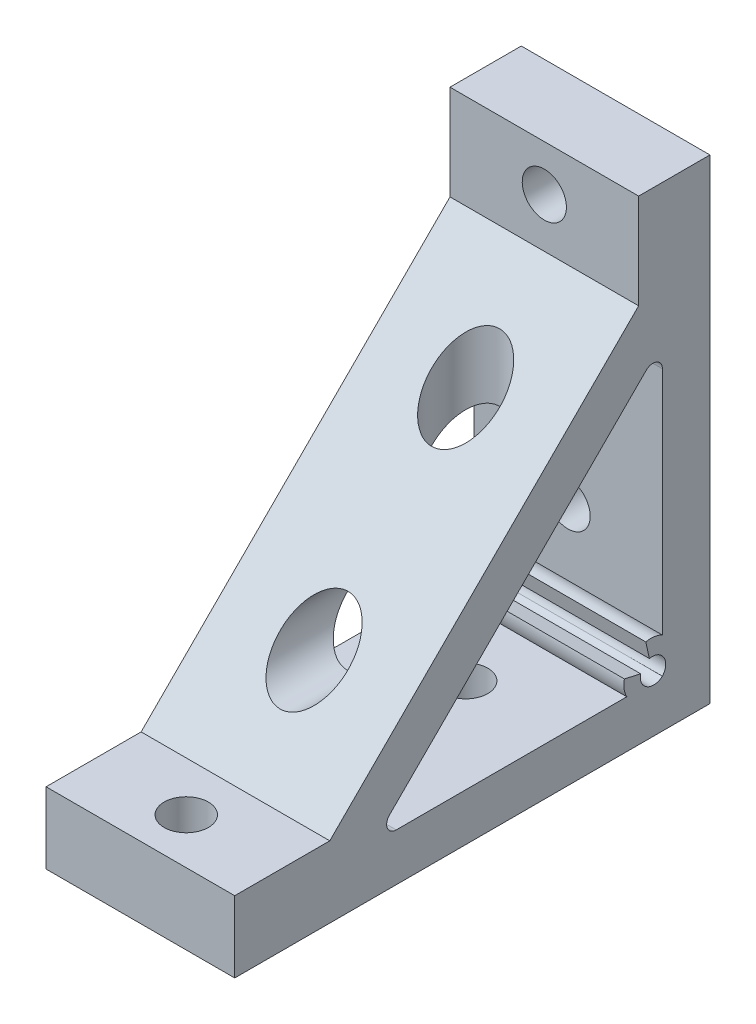
ISO-10303-21;
HEADER;
FILE_DESCRIPTION(('STEP AP214'),'2;1');
FILE_NAME('part.step','',(''),(''),'','','');
FILE_SCHEMA(('AUTOMOTIVE_DESIGN { 1 0 10303 214 1 1 1 1 }'));
ENDSEC;
DATA;
#1=APPLICATION_CONTEXT('core data for automotive mechanical design processes');
#2=APPLICATION_PROTOCOL_DEFINITION('international standard','automotive_design',2000,#1);
#3=PRODUCT_CONTEXT('',#1,'mechanical');
#4=PRODUCT('Part','Part','',(#3));
#5=PRODUCT_RELATED_PRODUCT_CATEGORY('part','',(#4));
#6=PRODUCT_DEFINITION_FORMATION('','',#4);
#7=PRODUCT_DEFINITION_CONTEXT('part definition',#1,'design');
#8=PRODUCT_DEFINITION('design','',#6,#7);
#9=PRODUCT_DEFINITION_SHAPE('','',#8);
#10=(LENGTH_UNIT() NAMED_UNIT(*) SI_UNIT(.MILLI.,.METRE.));
#11=(NAMED_UNIT(*) PLANE_ANGLE_UNIT() SI_UNIT($,.RADIAN.));
#12=(NAMED_UNIT(*) SI_UNIT($,.STERADIAN.) SOLID_ANGLE_UNIT());
#13=UNCERTAINTY_MEASURE_WITH_UNIT(LENGTH_MEASURE(1.E-05),#10,'distance_accuracy_value','');
#14=(GEOMETRIC_REPRESENTATION_CONTEXT(3) GLOBAL_UNCERTAINTY_ASSIGNED_CONTEXT((#13)) GLOBAL_UNIT_ASSIGNED_CONTEXT((#10,
#11,#12)) REPRESENTATION_CONTEXT('',''));
#15=CARTESIAN_POINT('',(0.,0.,0.));
#16=DIRECTION('',(0.,0.,1.));
#17=DIRECTION('',(1.,0.,0.));
#18=AXIS2_PLACEMENT_3D('',#15,#16,#17);
#19=CARTESIAN_POINT('',(0.,100.,40.35));
#20=DIRECTION('',(0.,-1.,0.));
#21=DIRECTION('',(0.,0.,1.));
#22=AXIS2_PLACEMENT_3D('',#19,#20,#21);
#23=CYLINDRICAL_SURFACE('',#22,4.65);
#24=CARTESIAN_POINT('',(0.,15.,40.35));
#25=DIRECTION('',(0.,1.,0.));
#26=DIRECTION('',(0.,0.,1.));
#27=AXIS2_PLACEMENT_3D('',#24,#25,#26);
#28=CIRCLE('',#27,4.65);
#29=CARTESIAN_POINT('',(0.,15.,45.));
#30=VERTEX_POINT('',#29);
#31=EDGE_CURVE('E23',#30,#30,#28,.T.);
#32=ORIENTED_EDGE('',*,*,#31,.T.);
#33=EDGE_LOOP('',(#32));
#34=FACE_BOUND('',#33,.T.);
#35=CARTESIAN_POINT('',(0.,0.,40.35));
#36=DIRECTION('',(0.,-1.,0.));
#37=DIRECTION('',(0.,0.,-1.));
#38=AXIS2_PLACEMENT_3D('',#35,#36,#37);
#39=CIRCLE('',#38,4.65);
#40=CARTESIAN_POINT('',(0.,0.,35.7));
#41=VERTEX_POINT('',#40);
#42=EDGE_CURVE('E10',#41,#41,#39,.T.);
#43=ORIENTED_EDGE('',*,*,#42,.T.);
#44=EDGE_LOOP('',(#43));
#45=FACE_BOUND('',#44,.T.);
#46=ADVANCED_FACE('F16',(#34,#45),#23,.F.);
#47=CARTESIAN_POINT('',(0.,100.,-18.45));
#48=DIRECTION('',(0.,-1.,0.));
#49=DIRECTION('',(0.,0.,1.));
#50=AXIS2_PLACEMENT_3D('',#47,#48,#49);
#51=CYLINDRICAL_SURFACE('',#50,4.65);
#52=CARTESIAN_POINT('',(0.,9.99999999999999,-18.45));
#53=DIRECTION('',(0.,1.,0.));
#54=DIRECTION('',(0.,0.,1.));
#55=AXIS2_PLACEMENT_3D('',#52,#53,#54);
#56=CIRCLE('',#55,4.65);
#57=CARTESIAN_POINT('',(0.,9.99999999999999,-13.8));
#58=VERTEX_POINT('',#57);
#59=EDGE_CURVE('E306',#58,#58,#56,.T.);
#60=ORIENTED_EDGE('',*,*,#59,.T.);
#61=EDGE_LOOP('',(#60));
#62=FACE_BOUND('',#61,.T.);
#63=CARTESIAN_POINT('',(0.,0.,-18.45));
#64=DIRECTION('',(0.,-1.,0.));
#65=DIRECTION('',(0.,0.,-1.));
#66=AXIS2_PLACEMENT_3D('',#63,#64,#65);
#67=CIRCLE('',#66,4.65);
#68=CARTESIAN_POINT('',(0.,0.,-23.1));
#69=VERTEX_POINT('',#68);
#70=EDGE_CURVE('E309',#69,#69,#67,.T.);
#71=ORIENTED_EDGE('',*,*,#70,.T.);
#72=EDGE_LOOP('',(#71));
#73=FACE_BOUND('',#72,.T.);
#74=ADVANCED_FACE('F367',(#62,#73),#51,.F.);
#75=CARTESIAN_POINT('',(0.,100.,-18.45));
#76=DIRECTION('',(0.,-1.,0.));
#77=DIRECTION('',(0.,0.,1.));
#78=AXIS2_PLACEMENT_3D('',#75,#76,#77);
#79=CYLINDRICAL_SURFACE('',#78,7.15);
#80=CARTESIAN_POINT('',(0.,49.3078643762691,-18.45));
#81=DIRECTION('',(0.,-0.707106781186547,-0.707106781186547));
#82=DIRECTION('',(0.,-0.707106781186548,0.707106781186548));
#83=AXIS2_PLACEMENT_3D('',#80,#81,#82);
#84=ELLIPSE('',#83,10.1116269709676,7.15);
#85=CARTESIAN_POINT('',(0.,42.1578643762691,-11.3));
#86=VERTEX_POINT('',#85);
#87=EDGE_CURVE('E288',#86,#86,#84,.T.);
#88=ORIENTED_EDGE('',*,*,#87,.T.);
#89=EDGE_LOOP('',(#88));
#90=FACE_BOUND('',#89,.T.);
#91=CARTESIAN_POINT('',(0.,63.45,-18.45));
#92=DIRECTION('',(0.,0.707106781186547,0.707106781186548));
#93=DIRECTION('',(0.,-0.707106781186548,0.707106781186547));
#94=AXIS2_PLACEMENT_3D('',#91,#92,#93);
#95=ELLIPSE('',#94,10.1116269709676,7.15);
#96=CARTESIAN_POINT('',(0.,56.3,-11.3));
#97=VERTEX_POINT('',#96);
#98=EDGE_CURVE('E303',#97,#97,#95,.T.);
#99=ORIENTED_EDGE('',*,*,#98,.T.);
#100=EDGE_LOOP('',(#99));
#101=FACE_BOUND('',#100,.T.);
#102=ADVANCED_FACE('F371',(#90,#101),#79,.F.);
#103=CARTESIAN_POINT('',(19.85,15.,50.));
#104=DIRECTION('',(0.,0.,-1.));
#105=DIRECTION('',(-1.,0.,0.));
#106=AXIS2_PLACEMENT_3D('',#103,#104,#105);
#107=PLANE('',#106);
#108=DIRECTION('',(0.,-1.,0.));
#109=VECTOR('',#108,1.);
#110=CARTESIAN_POINT('',(-19.85,15.,50.));
#111=LINE('',#110,#109);
#112=CARTESIAN_POINT('',(-19.85,15.,50.));
#113=VERTEX_POINT('',#112);
#114=CARTESIAN_POINT('',(-19.85,0.,50.));
#115=VERTEX_POINT('',#114);
#116=EDGE_CURVE('E195',#113,#115,#111,.T.);
#117=ORIENTED_EDGE('',*,*,#116,.T.);
#118=DIRECTION('',(-1.,0.,0.));
#119=VECTOR('',#118,1.);
#120=CARTESIAN_POINT('',(19.85,0.,50.));
#121=LINE('',#120,#119);
#122=CARTESIAN_POINT('',(19.85,0.,50.));
#123=VERTEX_POINT('',#122);
#124=EDGE_CURVE('E247',#123,#115,#121,.T.);
#125=ORIENTED_EDGE('',*,*,#124,.F.);
#126=DIRECTION('',(0.,-1.,0.));
#127=VECTOR('',#126,1.);
#128=CARTESIAN_POINT('',(19.85,15.,50.));
#129=LINE('',#128,#127);
#130=CARTESIAN_POINT('',(19.85,15.,50.));
#131=VERTEX_POINT('',#130);
#132=EDGE_CURVE('E200',#131,#123,#129,.T.);
#133=ORIENTED_EDGE('',*,*,#132,.F.);
#134=DIRECTION('',(-1.,0.,0.));
#135=VECTOR('',#134,1.);
#136=CARTESIAN_POINT('',(19.85,15.,50.));
#137=LINE('',#136,#135);
#138=EDGE_CURVE('E216',#131,#113,#137,.T.);
#139=ORIENTED_EDGE('',*,*,#138,.T.);
#140=EDGE_LOOP('',(#117,#125,#133,#139));
#141=FACE_BOUND('',#140,.T.);
#142=ADVANCED_FACE('F330',(#141),#107,.F.);
#143=CARTESIAN_POINT('',(19.85,0.,50.));
#144=DIRECTION('',(0.,1.,0.));
#145=DIRECTION('',(0.,0.,1.));
#146=AXIS2_PLACEMENT_3D('',#143,#144,#145);
#147=PLANE('',#146);
#148=ORIENTED_EDGE('',*,*,#70,.F.);
#149=EDGE_LOOP('',(#148));
#150=FACE_BOUND('',#149,.T.);
#151=ORIENTED_EDGE('',*,*,#42,.F.);
#152=EDGE_LOOP('',(#151));
#153=FACE_BOUND('',#152,.T.);
#154=DIRECTION('',(0.,0.,-1.));
#155=VECTOR('',#154,1.);
#156=CARTESIAN_POINT('',(-19.85,0.,50.));
#157=LINE('',#156,#155);
#158=CARTESIAN_POINT('',(-19.85,0.,-50.));
#159=VERTEX_POINT('',#158);
#160=EDGE_CURVE('E219',#115,#159,#157,.T.);
#161=ORIENTED_EDGE('',*,*,#160,.T.);
#162=DIRECTION('',(-1.,0.,0.));
#163=VECTOR('',#162,1.);
#164=CARTESIAN_POINT('',(19.85,0.,-50.));
#165=LINE('',#164,#163);
#166=CARTESIAN_POINT('',(19.85,0.,-50.));
#167=VERTEX_POINT('',#166);
#168=EDGE_CURVE('E244',#167,#159,#165,.T.);
#169=ORIENTED_EDGE('',*,*,#168,.F.);
#170=DIRECTION('',(0.,0.,-1.));
#171=VECTOR('',#170,1.);
#172=CARTESIAN_POINT('',(19.85,0.,50.));
#173=LINE('',#172,#171);
#174=EDGE_CURVE('E203',#123,#167,#173,.T.);
#175=ORIENTED_EDGE('',*,*,#174,.F.);
#176=ORIENTED_EDGE('',*,*,#124,.T.);
#177=EDGE_LOOP('',(#161,#169,#175,#176));
#178=FACE_BOUND('',#177,.T.);
#179=ADVANCED_FACE('F337',(#150,#153,#178),#147,.F.);
#180=CARTESIAN_POINT('',(19.85,0.,-50.));
#181=DIRECTION('',(0.,0.,1.));
#182=DIRECTION('',(0.,-1.,0.));
#183=AXIS2_PLACEMENT_3D('',#180,#181,#182);
#184=PLANE('',#183);
#185=CARTESIAN_POINT('',(0.,90.35,-50.));
#186=DIRECTION('',(0.,0.,1.));
#187=DIRECTION('',(0.,-1.,0.));
#188=AXIS2_PLACEMENT_3D('',#185,#186,#187);
#189=CIRCLE('',#188,4.65);
#190=CARTESIAN_POINT('',(0.,85.7,-50.));
#191=VERTEX_POINT('',#190);
#192=EDGE_CURVE('E297',#191,#191,#189,.T.);
#193=ORIENTED_EDGE('',*,*,#192,.T.);
#194=EDGE_LOOP('',(#193));
#195=FACE_BOUND('',#194,.T.);
#196=CARTESIAN_POINT('',(0.,31.55,-50.));
#197=DIRECTION('',(0.,0.,1.));
#198=DIRECTION('',(0.,-1.,0.));
#199=AXIS2_PLACEMENT_3D('',#196,#197,#198);
#200=CIRCLE('',#199,4.65);
#201=CARTESIAN_POINT('',(0.,26.9,-50.));
#202=VERTEX_POINT('',#201);
#203=EDGE_CURVE('E292',#202,#202,#200,.T.);
#204=ORIENTED_EDGE('',*,*,#203,.T.);
#205=EDGE_LOOP('',(#204));
#206=FACE_BOUND('',#205,.T.);
#207=DIRECTION('',(0.,1.,0.));
#208=VECTOR('',#207,1.);
#209=CARTESIAN_POINT('',(-19.85,0.,-50.));
#210=LINE('',#209,#208);
#211=CARTESIAN_POINT('',(-19.85,100.,-50.));
#212=VERTEX_POINT('',#211);
#213=EDGE_CURVE('E221',#159,#212,#210,.T.);
#214=ORIENTED_EDGE('',*,*,#213,.T.);
#215=DIRECTION('',(-1.,0.,0.));
#216=VECTOR('',#215,1.);
#217=CARTESIAN_POINT('',(19.85,100.,-50.));
#218=LINE('',#217,#216);
#219=CARTESIAN_POINT('',(19.85,100.,-50.));
#220=VERTEX_POINT('',#219);
#221=EDGE_CURVE('E241',#220,#212,#218,.T.);
#222=ORIENTED_EDGE('',*,*,#221,.F.);
#223=DIRECTION('',(0.,1.,0.));
#224=VECTOR('',#223,1.);
#225=CARTESIAN_POINT('',(19.85,0.,-50.));
#226=LINE('',#225,#224);
#227=EDGE_CURVE('E206',#167,#220,#226,.T.);
#228=ORIENTED_EDGE('',*,*,#227,.F.);
#229=ORIENTED_EDGE('',*,*,#168,.T.);
#230=EDGE_LOOP('',(#214,#222,#228,#229));
#231=FACE_BOUND('',#230,.T.);
#232=ADVANCED_FACE('F352',(#195,#206,#231),#184,.F.);
#233=CARTESIAN_POINT('',(19.85,100.,-50.));
#234=DIRECTION('',(0.,-1.,0.));
#235=DIRECTION('',(0.,0.,-1.));
#236=AXIS2_PLACEMENT_3D('',#233,#234,#235);
#237=PLANE('',#236);
#238=DIRECTION('',(0.,0.,1.));
#239=VECTOR('',#238,1.);
#240=CARTESIAN_POINT('',(-19.85,100.,-50.));
#241=LINE('',#240,#239);
#242=CARTESIAN_POINT('',(-19.85,100.,-35.));
#243=VERTEX_POINT('',#242);
#244=EDGE_CURVE('E223',#212,#243,#241,.T.);
#245=ORIENTED_EDGE('',*,*,#244,.T.);
#246=DIRECTION('',(-1.,0.,0.));
#247=VECTOR('',#246,1.);
#248=CARTESIAN_POINT('',(19.85,100.,-35.));
#249=LINE('',#248,#247);
#250=CARTESIAN_POINT('',(19.85,100.,-35.));
#251=VERTEX_POINT('',#250);
#252=EDGE_CURVE('E238',#251,#243,#249,.T.);
#253=ORIENTED_EDGE('',*,*,#252,.F.);
#254=DIRECTION('',(0.,0.,1.));
#255=VECTOR('',#254,1.);
#256=CARTESIAN_POINT('',(19.85,100.,-50.));
#257=LINE('',#256,#255);
#258=EDGE_CURVE('E208',#220,#251,#257,.T.);
#259=ORIENTED_EDGE('',*,*,#258,.F.);
#260=ORIENTED_EDGE('',*,*,#221,.T.);
#261=EDGE_LOOP('',(#245,#253,#259,#260));
#262=FACE_BOUND('',#261,.T.);
#263=ADVANCED_FACE('F349',(#262),#237,.F.);
#264=CARTESIAN_POINT('',(19.85,100.,-35.));
#265=DIRECTION('',(0.,0.,-1.));
#266=DIRECTION('',(0.,1.,0.));
#267=AXIS2_PLACEMENT_3D('',#264,#265,#266);
#268=PLANE('',#267);
#269=CARTESIAN_POINT('',(0.,90.35,-35.));
#270=DIRECTION('',(0.,0.,-1.));
#271=DIRECTION('',(0.,1.,0.));
#272=AXIS2_PLACEMENT_3D('',#269,#270,#271);
#273=CIRCLE('',#272,4.65);
#274=CARTESIAN_POINT('',(0.,95.,-35.));
#275=VERTEX_POINT('',#274);
#276=EDGE_CURVE('E294',#275,#275,#273,.T.);
#277=ORIENTED_EDGE('',*,*,#276,.T.);
#278=EDGE_LOOP('',(#277));
#279=FACE_BOUND('',#278,.T.);
#280=DIRECTION('',(0.,-1.,0.));
#281=VECTOR('',#280,1.);
#282=CARTESIAN_POINT('',(-19.85,100.,-35.));
#283=LINE('',#282,#281);
#284=CARTESIAN_POINT('',(-19.85,80.,-35.));
#285=VERTEX_POINT('',#284);
#286=EDGE_CURVE('E225',#243,#285,#283,.T.);
#287=ORIENTED_EDGE('',*,*,#286,.T.);
#288=DIRECTION('',(-1.,0.,0.));
#289=VECTOR('',#288,1.);
#290=CARTESIAN_POINT('',(19.85,80.,-35.));
#291=LINE('',#290,#289);
#292=CARTESIAN_POINT('',(19.85,80.,-35.));
#293=VERTEX_POINT('',#292);
#294=EDGE_CURVE('E235',#293,#285,#291,.T.);
#295=ORIENTED_EDGE('',*,*,#294,.F.);
#296=DIRECTION('',(0.,-1.,0.));
#297=VECTOR('',#296,1.);
#298=CARTESIAN_POINT('',(19.85,100.,-35.));
#299=LINE('',#298,#297);
#300=EDGE_CURVE('E210',#251,#293,#299,.T.);
#301=ORIENTED_EDGE('',*,*,#300,.F.);
#302=ORIENTED_EDGE('',*,*,#252,.T.);
#303=EDGE_LOOP('',(#287,#295,#301,#302));
#304=FACE_BOUND('',#303,.T.);
#305=ADVANCED_FACE('F345',(#279,#304),#268,.F.);
#306=CARTESIAN_POINT('',(19.85,80.,-35.));
#307=DIRECTION('',(0.,-0.707106781186547,-0.707106781186548));
#308=DIRECTION('',(0.,0.707106781186548,-0.707106781186547));
#309=AXIS2_PLACEMENT_3D('',#306,#307,#308);
#310=PLANE('',#309);
#311=ORIENTED_EDGE('',*,*,#98,.F.);
#312=EDGE_LOOP('',(#311));
#313=FACE_BOUND('',#312,.T.);
#314=CARTESIAN_POINT('',(0.,31.55,13.45));
#315=DIRECTION('',(0.,-0.707106781186547,-0.707106781186548));
#316=DIRECTION('',(0.,0.707106781186548,-0.707106781186547));
#317=AXIS2_PLACEMENT_3D('',#314,#315,#316);
#318=ELLIPSE('',#317,10.1116269709676,7.15);
#319=CARTESIAN_POINT('',(0.,38.7,6.30000000000003));
#320=VERTEX_POINT('',#319);
#321=EDGE_CURVE('E293',#320,#320,#318,.T.);
#322=ORIENTED_EDGE('',*,*,#321,.T.);
#323=EDGE_LOOP('',(#322));
#324=FACE_BOUND('',#323,.T.);
#325=DIRECTION('',(0.,-0.707106781186547,0.707106781186547));
#326=VECTOR('',#325,1.);
#327=CARTESIAN_POINT('',(-19.85,80.,-35.));
#328=LINE('',#327,#326);
#329=CARTESIAN_POINT('',(-19.85,15.,30.));
#330=VERTEX_POINT('',#329);
#331=EDGE_CURVE('E227',#285,#330,#328,.T.);
#332=ORIENTED_EDGE('',*,*,#331,.T.);
#333=DIRECTION('',(-1.,0.,0.));
#334=VECTOR('',#333,1.);
#335=CARTESIAN_POINT('',(19.85,15.,30.));
#336=LINE('',#335,#334);
#337=CARTESIAN_POINT('',(19.85,15.,30.));
#338=VERTEX_POINT('',#337);
#339=EDGE_CURVE('E232',#338,#330,#336,.T.);
#340=ORIENTED_EDGE('',*,*,#339,.F.);
#341=DIRECTION('',(0.,-0.707106781186547,0.707106781186547));
#342=VECTOR('',#341,1.);
#343=CARTESIAN_POINT('',(19.85,80.,-35.));
#344=LINE('',#343,#342);
#345=EDGE_CURVE('E212',#293,#338,#344,.T.);
#346=ORIENTED_EDGE('',*,*,#345,.F.);
#347=ORIENTED_EDGE('',*,*,#294,.T.);
#348=EDGE_LOOP('',(#332,#340,#346,#347));
#349=FACE_BOUND('',#348,.T.);
#350=ADVANCED_FACE('F319',(#313,#324,#349),#310,.F.);
#351=CARTESIAN_POINT('',(19.85,15.,30.));
#352=DIRECTION('',(0.,-1.,0.));
#353=DIRECTION('',(0.,0.,-1.));
#354=AXIS2_PLACEMENT_3D('',#351,#352,#353);
#355=PLANE('',#354);
#356=ORIENTED_EDGE('',*,*,#31,.F.);
#357=EDGE_LOOP('',(#356));
#358=FACE_BOUND('',#357,.T.);
#359=DIRECTION('',(0.,0.,1.));
#360=VECTOR('',#359,1.);
#361=CARTESIAN_POINT('',(-19.85,15.,30.));
#362=LINE('',#361,#360);
#363=EDGE_CURVE('E204',#330,#113,#362,.T.);
#364=ORIENTED_EDGE('',*,*,#363,.T.);
#365=ORIENTED_EDGE('',*,*,#138,.F.);
#366=DIRECTION('',(0.,0.,1.));
#367=VECTOR('',#366,1.);
#368=CARTESIAN_POINT('',(19.85,15.,30.));
#369=LINE('',#368,#367);
#370=EDGE_CURVE('E214',#338,#131,#369,.T.);
#371=ORIENTED_EDGE('',*,*,#370,.F.);
#372=ORIENTED_EDGE('',*,*,#339,.T.);
#373=EDGE_LOOP('',(#364,#365,#371,#372));
#374=FACE_BOUND('',#373,.T.);
#375=ADVANCED_FACE('F316',(#358,#374),#355,.F.);
#376=CARTESIAN_POINT('',(19.85,0.,0.));
#377=DIRECTION('',(1.,0.,0.));
#378=DIRECTION('',(0.,0.,-1.));
#379=AXIS2_PLACEMENT_3D('',#376,#377,#378);
#380=PLANE('',#379);
#381=DIRECTION('',(0.,0.,1.));
#382=VECTOR('',#381,1.);
#383=CARTESIAN_POINT('',(19.85,9.99999999999969,20.8578643762694));
#384=LINE('',#383,#382);
#385=CARTESIAN_POINT('',(19.85,9.99999999999992,-32.5));
#386=VERTEX_POINT('',#385);
#387=CARTESIAN_POINT('',(19.85,9.99999999999971,16.0294372515232));
#388=VERTEX_POINT('',#387);
#389=EDGE_CURVE('E183',#386,#388,#384,.T.);
#390=ORIENTED_EDGE('',*,*,#389,.T.);
#391=CARTESIAN_POINT('',(19.85,11.9999999999997,16.0294372515232));
#392=DIRECTION('',(1.,0.,0.));
#393=DIRECTION('',(0.,0.,-1.));
#394=AXIS2_PLACEMENT_3D('',#391,#392,#393);
#395=CIRCLE('',#394,2.);
#396=CARTESIAN_POINT('',(19.85,13.4142135623728,17.4436508138963));
#397=VERTEX_POINT('',#396);
#398=EDGE_CURVE('E284',#388,#397,#395,.F.);
#399=ORIENTED_EDGE('',*,*,#398,.T.);
#400=DIRECTION('',(0.,0.707106781186548,-0.707106781186547));
#401=VECTOR('',#400,1.);
#402=CARTESIAN_POINT('',(19.85,70.8578643762691,-40.));
#403=LINE('',#402,#401);
#404=CARTESIAN_POINT('',(19.85,67.443650813896,-36.5857864376269));
#405=VERTEX_POINT('',#404);
#406=EDGE_CURVE('E169',#397,#405,#403,.T.);
#407=ORIENTED_EDGE('',*,*,#406,.T.);
#408=CARTESIAN_POINT('',(19.85,66.0294372515229,-38.));
#409=DIRECTION('',(1.,0.,0.));
#410=DIRECTION('',(0.,0.,-1.));
#411=AXIS2_PLACEMENT_3D('',#408,#409,#410);
#412=CIRCLE('',#411,2.);
#413=CARTESIAN_POINT('',(19.85,66.0294372515229,-40.));
#414=VERTEX_POINT('',#413);
#415=EDGE_CURVE('E38',#405,#414,#412,.F.);
#416=ORIENTED_EDGE('',*,*,#415,.T.);
#417=DIRECTION('',(0.,-1.,0.));
#418=VECTOR('',#417,1.);
#419=CARTESIAN_POINT('',(19.85,17.5,-40.));
#420=LINE('',#419,#418);
#421=CARTESIAN_POINT('',(19.85,17.5,-40.));
#422=VERTEX_POINT('',#421);
#423=EDGE_CURVE('E167',#414,#422,#420,.T.);
#424=ORIENTED_EDGE('',*,*,#423,.T.);
#425=CARTESIAN_POINT('',(19.85,13.119935205637,-37.5885621722338));
#426=DIRECTION('',(1.,0.,0.));
#427=DIRECTION('',(0.,0.,-1.));
#428=AXIS2_PLACEMENT_3D('',#425,#426,#427);
#429=CIRCLE('',#428,5.00000000000001);
#430=CARTESIAN_POINT('',(19.85,18.,-36.5));
#431=VERTEX_POINT('',#430);
#432=EDGE_CURVE('E147',#422,#431,#429,.T.);
#433=ORIENTED_EDGE('',*,*,#432,.T.);
#434=DIRECTION('',(0.,-0.976012958872607,-0.217712434446771));
#435=VECTOR('',#434,1.);
#436=CARTESIAN_POINT('',(19.85,18.,-36.5));
#437=LINE('',#436,#435);
#438=CARTESIAN_POINT('',(19.85,14.5839546439459,-37.2619935205637));
#439=VERTEX_POINT('',#438);
#440=EDGE_CURVE('E158',#431,#439,#437,.T.);
#441=ORIENTED_EDGE('',*,*,#440,.T.);
#442=CARTESIAN_POINT('',(19.85,11.8398785064693,-37.8740955329052));
#443=DIRECTION('',(-1.,0.,0.));
#444=DIRECTION('',(0.,0.,1.));
#445=AXIS2_PLACEMENT_3D('',#442,#443,#444);
#446=CIRCLE('',#445,2.81151608954691);
#447=CARTESIAN_POINT('',(19.85,10.,-40.));
#448=VERTEX_POINT('',#447);
#449=EDGE_CURVE('E162',#439,#448,#446,.T.);
#450=ORIENTED_EDGE('',*,*,#449,.T.);
#451=CARTESIAN_POINT('',(19.85,12.1259044670948,-38.1601214935307));
#452=DIRECTION('',(-1.,0.,0.));
#453=DIRECTION('',(0.,0.,-1.));
#454=AXIS2_PLACEMENT_3D('',#451,#452,#453);
#455=CIRCLE('',#454,2.81151608954691);
#456=CARTESIAN_POINT('',(19.85,12.7380064794363,-35.4160453560541));
#457=VERTEX_POINT('',#456);
#458=EDGE_CURVE('E174',#448,#457,#455,.T.);
#459=ORIENTED_EDGE('',*,*,#458,.T.);
#460=DIRECTION('',(0.,0.21771243444676,0.976012958872609));
#461=VECTOR('',#460,1.);
#462=CARTESIAN_POINT('',(19.85,13.5,-32.));
#463=LINE('',#462,#461);
#464=CARTESIAN_POINT('',(19.85,13.5,-32.));
#465=VERTEX_POINT('',#464);
#466=EDGE_CURVE('E177',#457,#465,#463,.T.);
#467=ORIENTED_EDGE('',*,*,#466,.T.);
#468=CARTESIAN_POINT('',(19.85,12.4114378277662,-36.880064794363));
#469=DIRECTION('',(1.,0.,0.));
#470=DIRECTION('',(0.,0.,1.));
#471=AXIS2_PLACEMENT_3D('',#468,#469,#470);
#472=CIRCLE('',#471,5.00000000000001);
#473=EDGE_CURVE('E180',#465,#386,#472,.T.);
#474=ORIENTED_EDGE('',*,*,#473,.T.);
#475=EDGE_LOOP('',(#390,#399,#407,#416,#424,#433,#441,#450,#459,#467,#474));
#476=FACE_BOUND('',#475,.T.);
#477=ORIENTED_EDGE('',*,*,#132,.T.);
#478=ORIENTED_EDGE('',*,*,#174,.T.);
#479=ORIENTED_EDGE('',*,*,#227,.T.);
#480=ORIENTED_EDGE('',*,*,#258,.T.);
#481=ORIENTED_EDGE('',*,*,#300,.T.);
#482=ORIENTED_EDGE('',*,*,#345,.T.);
#483=ORIENTED_EDGE('',*,*,#370,.T.);
#484=EDGE_LOOP('',(#477,#478,#479,#480,#481,#482,#483));
#485=FACE_BOUND('',#484,.T.);
#486=ADVANCED_FACE('F165',(#476,#485),#380,.T.);
#487=CARTESIAN_POINT('',(-19.85,0.,0.));
#488=DIRECTION('',(1.,0.,0.));
#489=DIRECTION('',(0.,0.,-1.));
#490=AXIS2_PLACEMENT_3D('',#487,#488,#489);
#491=PLANE('',#490);
#492=DIRECTION('',(0.,1.,0.));
#493=VECTOR('',#492,1.);
#494=CARTESIAN_POINT('',(-19.85,0.,-40.));
#495=LINE('',#494,#493);
#496=CARTESIAN_POINT('',(-19.85,17.5,-40.));
#497=VERTEX_POINT('',#496);
#498=CARTESIAN_POINT('',(-19.85,66.0294372515229,-40.));
#499=VERTEX_POINT('',#498);
#500=EDGE_CURVE('E250',#497,#499,#495,.T.);
#501=ORIENTED_EDGE('',*,*,#500,.T.);
#502=CARTESIAN_POINT('',(-19.85,66.0294372515229,-38.));
#503=DIRECTION('',(1.,0.,0.));
#504=DIRECTION('',(0.,0.,-1.));
#505=AXIS2_PLACEMENT_3D('',#502,#503,#504);
#506=CIRCLE('',#505,2.);
#507=CARTESIAN_POINT('',(-19.85,67.443650813896,-36.5857864376269));
#508=VERTEX_POINT('',#507);
#509=EDGE_CURVE('E30',#499,#508,#506,.T.);
#510=ORIENTED_EDGE('',*,*,#509,.T.);
#511=DIRECTION('',(0.,-0.707106781186548,0.707106781186547));
#512=VECTOR('',#511,1.);
#513=CARTESIAN_POINT('',(-19.85,15.4289321881345,15.4289321881345));
#514=LINE('',#513,#512);
#515=CARTESIAN_POINT('',(-19.85,13.4142135623728,17.4436508138963));
#516=VERTEX_POINT('',#515);
#517=EDGE_CURVE('E263',#508,#516,#514,.T.);
#518=ORIENTED_EDGE('',*,*,#517,.T.);
#519=CARTESIAN_POINT('',(-19.85,11.9999999999997,16.0294372515232));
#520=DIRECTION('',(1.,0.,0.));
#521=DIRECTION('',(0.,0.,-1.));
#522=AXIS2_PLACEMENT_3D('',#519,#520,#521);
#523=CIRCLE('',#522,2.);
#524=CARTESIAN_POINT('',(-19.85,9.99999999999971,16.0294372515232));
#525=VERTEX_POINT('',#524);
#526=EDGE_CURVE('E282',#516,#525,#523,.T.);
#527=ORIENTED_EDGE('',*,*,#526,.T.);
#528=DIRECTION('',(0.,0.,-1.));
#529=VECTOR('',#528,1.);
#530=CARTESIAN_POINT('',(-19.85,9.99999999999978,0.));
#531=LINE('',#530,#529);
#532=CARTESIAN_POINT('',(-19.85,9.99999999999991,-32.5));
#533=VERTEX_POINT('',#532);
#534=EDGE_CURVE('E261',#525,#533,#531,.T.);
#535=ORIENTED_EDGE('',*,*,#534,.T.);
#536=CARTESIAN_POINT('',(-19.85,12.4114378277662,-36.880064794363));
#537=DIRECTION('',(-1.,0.,0.));
#538=DIRECTION('',(0.,0.,1.));
#539=AXIS2_PLACEMENT_3D('',#536,#537,#538);
#540=CIRCLE('',#539,5.00000000000001);
#541=CARTESIAN_POINT('',(-19.85,13.5,-32.));
#542=VERTEX_POINT('',#541);
#543=EDGE_CURVE('E264',#533,#542,#540,.T.);
#544=ORIENTED_EDGE('',*,*,#543,.T.);
#545=DIRECTION('',(0.,-0.21771243444676,-0.976012958872609));
#546=VECTOR('',#545,1.);
#547=CARTESIAN_POINT('',(-19.85,13.5,-32.));
#548=LINE('',#547,#546);
#549=CARTESIAN_POINT('',(-19.85,12.7380064794363,-35.4160453560541));
#550=VERTEX_POINT('',#549);
#551=EDGE_CURVE('E260',#542,#550,#548,.T.);
#552=ORIENTED_EDGE('',*,*,#551,.T.);
#553=CARTESIAN_POINT('',(-19.85,12.1259044670948,-38.1601214935307));
#554=DIRECTION('',(1.,0.,0.));
#555=DIRECTION('',(0.,0.,-1.));
#556=AXIS2_PLACEMENT_3D('',#553,#554,#555);
#557=CIRCLE('',#556,2.81151608954691);
#558=CARTESIAN_POINT('',(-19.85,10.,-40.));
#559=VERTEX_POINT('',#558);
#560=EDGE_CURVE('E256',#550,#559,#557,.T.);
#561=ORIENTED_EDGE('',*,*,#560,.T.);
#562=CARTESIAN_POINT('',(-19.85,11.8398785064693,-37.8740955329052));
#563=DIRECTION('',(1.,0.,0.));
#564=DIRECTION('',(0.,0.,-1.));
#565=AXIS2_PLACEMENT_3D('',#562,#563,#564);
#566=CIRCLE('',#565,2.81151608954691);
#567=CARTESIAN_POINT('',(-19.85,14.5839546439459,-37.2619935205637));
#568=VERTEX_POINT('',#567);
#569=EDGE_CURVE('E253',#559,#568,#566,.T.);
#570=ORIENTED_EDGE('',*,*,#569,.T.);
#571=DIRECTION('',(0.,0.976012958872606,0.217712434446772));
#572=VECTOR('',#571,1.);
#573=CARTESIAN_POINT('',(-19.85,14.5839546439459,-37.2619935205637));
#574=LINE('',#573,#572);
#575=CARTESIAN_POINT('',(-19.85,18.,-36.5));
#576=VERTEX_POINT('',#575);
#577=EDGE_CURVE('E257',#568,#576,#574,.T.);
#578=ORIENTED_EDGE('',*,*,#577,.T.);
#579=CARTESIAN_POINT('',(-19.85,13.119935205637,-37.5885621722338));
#580=DIRECTION('',(-1.,0.,0.));
#581=DIRECTION('',(0.,0.,1.));
#582=AXIS2_PLACEMENT_3D('',#579,#580,#581);
#583=CIRCLE('',#582,5.00000000000001);
#584=EDGE_CURVE('E150',#576,#497,#583,.T.);
#585=ORIENTED_EDGE('',*,*,#584,.T.);
#586=EDGE_LOOP('',(#501,#510,#518,#527,#535,#544,#552,#561,#570,#578,#585));
#587=FACE_BOUND('',#586,.T.);
#588=ORIENTED_EDGE('',*,*,#116,.F.);
#589=ORIENTED_EDGE('',*,*,#363,.F.);
#590=ORIENTED_EDGE('',*,*,#331,.F.);
#591=ORIENTED_EDGE('',*,*,#286,.F.);
#592=ORIENTED_EDGE('',*,*,#244,.F.);
#593=ORIENTED_EDGE('',*,*,#213,.F.);
#594=ORIENTED_EDGE('',*,*,#160,.F.);
#595=EDGE_LOOP('',(#588,#589,#590,#591,#592,#593,#594));
#596=FACE_BOUND('',#595,.T.);
#597=ADVANCED_FACE('F332',(#587,#596),#491,.F.);
#598=CARTESIAN_POINT('',(19.85,70.8578643762691,-40.));
#599=DIRECTION('',(0.,0.707106781186547,0.707106781186548));
#600=DIRECTION('',(0.,-0.707106781186548,0.707106781186547));
#601=AXIS2_PLACEMENT_3D('',#598,#599,#600);
#602=PLANE('',#601);
#603=ORIENTED_EDGE('',*,*,#87,.F.);
#604=EDGE_LOOP('',(#603));
#605=FACE_BOUND('',#604,.T.);
#606=CARTESIAN_POINT('',(0.,31.55,-0.692135623730904));
#607=DIRECTION('',(0.,0.707106781186547,0.707106781186548));
#608=DIRECTION('',(0.,0.707106781186548,-0.707106781186547));
#609=AXIS2_PLACEMENT_3D('',#606,#607,#608);
#610=ELLIPSE('',#609,10.1116269709676,7.15);
#611=CARTESIAN_POINT('',(0.,38.7,-7.8421356237309));
#612=VERTEX_POINT('',#611);
#613=EDGE_CURVE('E298',#612,#612,#610,.T.);
#614=ORIENTED_EDGE('',*,*,#613,.T.);
#615=EDGE_LOOP('',(#614));
#616=FACE_BOUND('',#615,.T.);
#617=ORIENTED_EDGE('',*,*,#406,.F.);
#618=DIRECTION('',(-1.,0.,0.));
#619=VECTOR('',#618,1.);
#620=CARTESIAN_POINT('',(-19.85,13.4142135623728,17.4436508138963));
#621=LINE('',#620,#619);
#622=EDGE_CURVE('E275',#397,#516,#621,.T.);
#623=ORIENTED_EDGE('',*,*,#622,.T.);
#624=ORIENTED_EDGE('',*,*,#517,.F.);
#625=DIRECTION('',(-1.,0.,0.));
#626=VECTOR('',#625,1.);
#627=CARTESIAN_POINT('',(19.85,67.443650813896,-36.5857864376269));
#628=LINE('',#627,#626);
#629=EDGE_CURVE('E267',#508,#405,#628,.F.);
#630=ORIENTED_EDGE('',*,*,#629,.T.);
#631=EDGE_LOOP('',(#617,#623,#624,#630));
#632=FACE_BOUND('',#631,.T.);
#633=ADVANCED_FACE('F461',(#605,#616,#632),#602,.F.);
#634=CARTESIAN_POINT('',(19.85,9.99999999999969,20.8578643762694));
#635=DIRECTION('',(0.,-1.,0.));
#636=DIRECTION('',(0.,0.,-1.));
#637=AXIS2_PLACEMENT_3D('',#634,#635,#636);
#638=PLANE('',#637);
#639=ORIENTED_EDGE('',*,*,#59,.F.);
#640=EDGE_LOOP('',(#639));
#641=FACE_BOUND('',#640,.T.);
#642=ORIENTED_EDGE('',*,*,#534,.F.);
#643=DIRECTION('',(-1.,0.,0.));
#644=VECTOR('',#643,1.);
#645=CARTESIAN_POINT('',(19.85,9.99999999999971,16.0294372515232));
#646=LINE('',#645,#644);
#647=EDGE_CURVE('E278',#525,#388,#646,.F.);
#648=ORIENTED_EDGE('',*,*,#647,.T.);
#649=ORIENTED_EDGE('',*,*,#389,.F.);
#650=DIRECTION('',(-1.,0.,0.));
#651=VECTOR('',#650,1.);
#652=CARTESIAN_POINT('',(19.85,9.99999999999992,-32.5));
#653=LINE('',#652,#651);
#654=EDGE_CURVE('E192',#386,#533,#653,.T.);
#655=ORIENTED_EDGE('',*,*,#654,.T.);
#656=EDGE_LOOP('',(#642,#648,#649,#655));
#657=FACE_BOUND('',#656,.T.);
#658=ADVANCED_FACE('F471',(#641,#657),#638,.F.);
#659=CARTESIAN_POINT('',(19.85,12.4114378277662,-36.880064794363));
#660=DIRECTION('',(-1.,0.,0.));
#661=DIRECTION('',(0.,0.,1.));
#662=AXIS2_PLACEMENT_3D('',#659,#660,#661);
#663=CYLINDRICAL_SURFACE('',#662,5.00000000000001);
#664=ORIENTED_EDGE('',*,*,#654,.F.);
#665=ORIENTED_EDGE('',*,*,#473,.F.);
#666=DIRECTION('',(-1.,0.,0.));
#667=VECTOR('',#666,1.);
#668=CARTESIAN_POINT('',(19.85,13.5,-32.));
#669=LINE('',#668,#667);
#670=EDGE_CURVE('E189',#465,#542,#669,.T.);
#671=ORIENTED_EDGE('',*,*,#670,.T.);
#672=ORIENTED_EDGE('',*,*,#543,.F.);
#673=EDGE_LOOP('',(#664,#665,#671,#672));
#674=FACE_BOUND('',#673,.T.);
#675=ADVANCED_FACE('F481',(#674),#663,.T.);
#676=CARTESIAN_POINT('',(19.85,13.5,-32.));
#677=DIRECTION('',(0.,-0.976012958872609,0.21771243444676));
#678=DIRECTION('',(0.,-0.21771243444676,-0.976012958872609));
#679=AXIS2_PLACEMENT_3D('',#676,#677,#678);
#680=PLANE('',#679);
#681=ORIENTED_EDGE('',*,*,#670,.F.);
#682=ORIENTED_EDGE('',*,*,#466,.F.);
#683=DIRECTION('',(-1.,0.,0.));
#684=VECTOR('',#683,1.);
#685=CARTESIAN_POINT('',(19.85,12.7380064794363,-35.4160453560541));
#686=LINE('',#685,#684);
#687=EDGE_CURVE('E188',#457,#550,#686,.T.);
#688=ORIENTED_EDGE('',*,*,#687,.T.);
#689=ORIENTED_EDGE('',*,*,#551,.F.);
#690=EDGE_LOOP('',(#681,#682,#688,#689));
#691=FACE_BOUND('',#690,.T.);
#692=ADVANCED_FACE('F491',(#691),#680,.F.);
#693=CARTESIAN_POINT('',(19.85,12.1259044670948,-38.1601214935307));
#694=DIRECTION('',(-1.,0.,0.));
#695=DIRECTION('',(0.,0.,1.));
#696=AXIS2_PLACEMENT_3D('',#693,#694,#695);
#697=CYLINDRICAL_SURFACE('',#696,2.81151608954691);
#698=ORIENTED_EDGE('',*,*,#687,.F.);
#699=ORIENTED_EDGE('',*,*,#458,.F.);
#700=DIRECTION('',(-1.,0.,0.));
#701=VECTOR('',#700,1.);
#702=CARTESIAN_POINT('',(19.85,10.,-40.));
#703=LINE('',#702,#701);
#704=EDGE_CURVE('E185',#448,#559,#703,.T.);
#705=ORIENTED_EDGE('',*,*,#704,.T.);
#706=ORIENTED_EDGE('',*,*,#560,.F.);
#707=EDGE_LOOP('',(#698,#699,#705,#706));
#708=FACE_BOUND('',#707,.T.);
#709=ADVANCED_FACE('F501',(#708),#697,.F.);
#710=CARTESIAN_POINT('',(19.85,11.8398785064693,-37.8740955329052));
#711=DIRECTION('',(-1.,0.,0.));
#712=DIRECTION('',(0.,0.,1.));
#713=AXIS2_PLACEMENT_3D('',#710,#711,#712);
#714=CYLINDRICAL_SURFACE('',#713,2.81151608954691);
#715=ORIENTED_EDGE('',*,*,#704,.F.);
#716=ORIENTED_EDGE('',*,*,#449,.F.);
#717=DIRECTION('',(-1.,0.,0.));
#718=VECTOR('',#717,1.);
#719=CARTESIAN_POINT('',(19.85,14.5839546439459,-37.2619935205637));
#720=LINE('',#719,#718);
#721=EDGE_CURVE('E154',#439,#568,#720,.T.);
#722=ORIENTED_EDGE('',*,*,#721,.T.);
#723=ORIENTED_EDGE('',*,*,#569,.F.);
#724=EDGE_LOOP('',(#715,#716,#722,#723));
#725=FACE_BOUND('',#724,.T.);
#726=ADVANCED_FACE('F511',(#725),#714,.F.);
#727=CARTESIAN_POINT('',(19.85,18.,-36.5));
#728=DIRECTION('',(0.,0.217712434446771,-0.976012958872607));
#729=DIRECTION('',(0.,0.976012958872607,0.217712434446771));
#730=AXIS2_PLACEMENT_3D('',#727,#728,#729);
#731=PLANE('',#730);
#732=ORIENTED_EDGE('',*,*,#721,.F.);
#733=ORIENTED_EDGE('',*,*,#440,.F.);
#734=DIRECTION('',(-1.,0.,0.));
#735=VECTOR('',#734,1.);
#736=CARTESIAN_POINT('',(19.85,18.,-36.5));
#737=LINE('',#736,#735);
#738=EDGE_CURVE('E142',#431,#576,#737,.T.);
#739=ORIENTED_EDGE('',*,*,#738,.T.);
#740=ORIENTED_EDGE('',*,*,#577,.F.);
#741=EDGE_LOOP('',(#732,#733,#739,#740));
#742=FACE_BOUND('',#741,.T.);
#743=ADVANCED_FACE('F159',(#742),#731,.F.);
#744=CARTESIAN_POINT('',(19.85,13.119935205637,-37.5885621722338));
#745=DIRECTION('',(-1.,0.,0.));
#746=DIRECTION('',(0.,0.,1.));
#747=AXIS2_PLACEMENT_3D('',#744,#745,#746);
#748=CYLINDRICAL_SURFACE('',#747,5.00000000000001);
#749=ORIENTED_EDGE('',*,*,#738,.F.);
#750=ORIENTED_EDGE('',*,*,#432,.F.);
#751=DIRECTION('',(-1.,0.,0.));
#752=VECTOR('',#751,1.);
#753=CARTESIAN_POINT('',(19.85,17.5,-40.));
#754=LINE('',#753,#752);
#755=EDGE_CURVE('E155',#422,#497,#754,.T.);
#756=ORIENTED_EDGE('',*,*,#755,.T.);
#757=ORIENTED_EDGE('',*,*,#584,.F.);
#758=EDGE_LOOP('',(#749,#750,#756,#757));
#759=FACE_BOUND('',#758,.T.);
#760=ADVANCED_FACE('F144',(#759),#748,.T.);
#761=CARTESIAN_POINT('',(19.85,17.5,-40.));
#762=DIRECTION('',(0.,0.,-1.));
#763=DIRECTION('',(0.,1.,0.));
#764=AXIS2_PLACEMENT_3D('',#761,#762,#763);
#765=PLANE('',#764);
#766=CARTESIAN_POINT('',(0.,31.55,-40.));
#767=DIRECTION('',(0.,0.,-1.));
#768=DIRECTION('',(0.,1.,0.));
#769=AXIS2_PLACEMENT_3D('',#766,#767,#768);
#770=CIRCLE('',#769,4.65);
#771=CARTESIAN_POINT('',(0.,36.2,-40.));
#772=VERTEX_POINT('',#771);
#773=EDGE_CURVE('E289',#772,#772,#770,.T.);
#774=ORIENTED_EDGE('',*,*,#773,.T.);
#775=EDGE_LOOP('',(#774));
#776=FACE_BOUND('',#775,.T.);
#777=ORIENTED_EDGE('',*,*,#423,.F.);
#778=DIRECTION('',(-1.,0.,0.));
#779=VECTOR('',#778,1.);
#780=CARTESIAN_POINT('',(-19.85,66.0294372515229,-40.));
#781=LINE('',#780,#779);
#782=EDGE_CURVE('E280',#414,#499,#781,.T.);
#783=ORIENTED_EDGE('',*,*,#782,.T.);
#784=ORIENTED_EDGE('',*,*,#500,.F.);
#785=ORIENTED_EDGE('',*,*,#755,.F.);
#786=EDGE_LOOP('',(#777,#783,#784,#785));
#787=FACE_BOUND('',#786,.T.);
#788=ADVANCED_FACE('F387',(#776,#787),#765,.F.);
#789=CARTESIAN_POINT('',(19.85,11.9999999999997,16.0294372515232));
#790=DIRECTION('',(1.,0.,0.));
#791=DIRECTION('',(0.,0.,-1.));
#792=AXIS2_PLACEMENT_3D('',#789,#790,#791);
#793=CYLINDRICAL_SURFACE('',#792,2.);
#794=ORIENTED_EDGE('',*,*,#398,.F.);
#795=ORIENTED_EDGE('',*,*,#647,.F.);
#796=ORIENTED_EDGE('',*,*,#526,.F.);
#797=ORIENTED_EDGE('',*,*,#622,.F.);
#798=EDGE_LOOP('',(#794,#795,#796,#797));
#799=FACE_BOUND('',#798,.T.);
#800=ADVANCED_FACE('F384',(#799),#793,.F.);
#801=CARTESIAN_POINT('',(19.85,66.0294372515229,-38.));
#802=DIRECTION('',(1.,0.,0.));
#803=DIRECTION('',(0.,0.,-1.));
#804=AXIS2_PLACEMENT_3D('',#801,#802,#803);
#805=CYLINDRICAL_SURFACE('',#804,2.);
#806=ORIENTED_EDGE('',*,*,#415,.F.);
#807=ORIENTED_EDGE('',*,*,#629,.F.);
#808=ORIENTED_EDGE('',*,*,#509,.F.);
#809=ORIENTED_EDGE('',*,*,#782,.F.);
#810=EDGE_LOOP('',(#806,#807,#808,#809));
#811=FACE_BOUND('',#810,.T.);
#812=ADVANCED_FACE('F380',(#811),#805,.F.);
#813=CARTESIAN_POINT('',(0.,31.55,50.));
#814=DIRECTION('',(0.,0.,-1.));
#815=DIRECTION('',(0.,1.,0.));
#816=AXIS2_PLACEMENT_3D('',#813,#814,#815);
#817=CYLINDRICAL_SURFACE('',#816,4.65);
#818=ORIENTED_EDGE('',*,*,#773,.F.);
#819=EDGE_LOOP('',(#818));
#820=FACE_BOUND('',#819,.T.);
#821=ORIENTED_EDGE('',*,*,#203,.F.);
#822=EDGE_LOOP('',(#821));
#823=FACE_BOUND('',#822,.T.);
#824=ADVANCED_FACE('F383',(#820,#823),#817,.F.);
#825=CARTESIAN_POINT('',(0.,90.35,50.));
#826=DIRECTION('',(0.,0.,-1.));
#827=DIRECTION('',(0.,1.,0.));
#828=AXIS2_PLACEMENT_3D('',#825,#826,#827);
#829=CYLINDRICAL_SURFACE('',#828,4.65);
#830=ORIENTED_EDGE('',*,*,#276,.F.);
#831=EDGE_LOOP('',(#830));
#832=FACE_BOUND('',#831,.T.);
#833=ORIENTED_EDGE('',*,*,#192,.F.);
#834=EDGE_LOOP('',(#833));
#835=FACE_BOUND('',#834,.T.);
#836=ADVANCED_FACE('F565',(#832,#835),#829,.F.);
#837=CARTESIAN_POINT('',(0.,31.55,50.));
#838=DIRECTION('',(0.,0.,-1.));
#839=DIRECTION('',(0.,1.,0.));
#840=AXIS2_PLACEMENT_3D('',#837,#838,#839);
#841=CYLINDRICAL_SURFACE('',#840,7.15);
#842=ORIENTED_EDGE('',*,*,#613,.F.);
#843=EDGE_LOOP('',(#842));
#844=FACE_BOUND('',#843,.T.);
#845=ORIENTED_EDGE('',*,*,#321,.F.);
#846=EDGE_LOOP('',(#845));
#847=FACE_BOUND('',#846,.T.);
#848=ADVANCED_FACE('F575',(#844,#847),#841,.F.);
#849=CLOSED_SHELL('',(#46,#74,#102,#142,#179,#232,#263,#305,#350,#375,#486,#597,#633,#658,#675,
#692,#709,#726,#743,#760,#788,#800,#812,#824,#836,#848));
#850=MANIFOLD_SOLID_BREP('B1',#849);
#851=ADVANCED_BREP_SHAPE_REPRESENTATION('',(#18,#850),#14);
#852=SHAPE_DEFINITION_REPRESENTATION(#9,#851);
ENDSEC;
END-ISO-10303-21;
